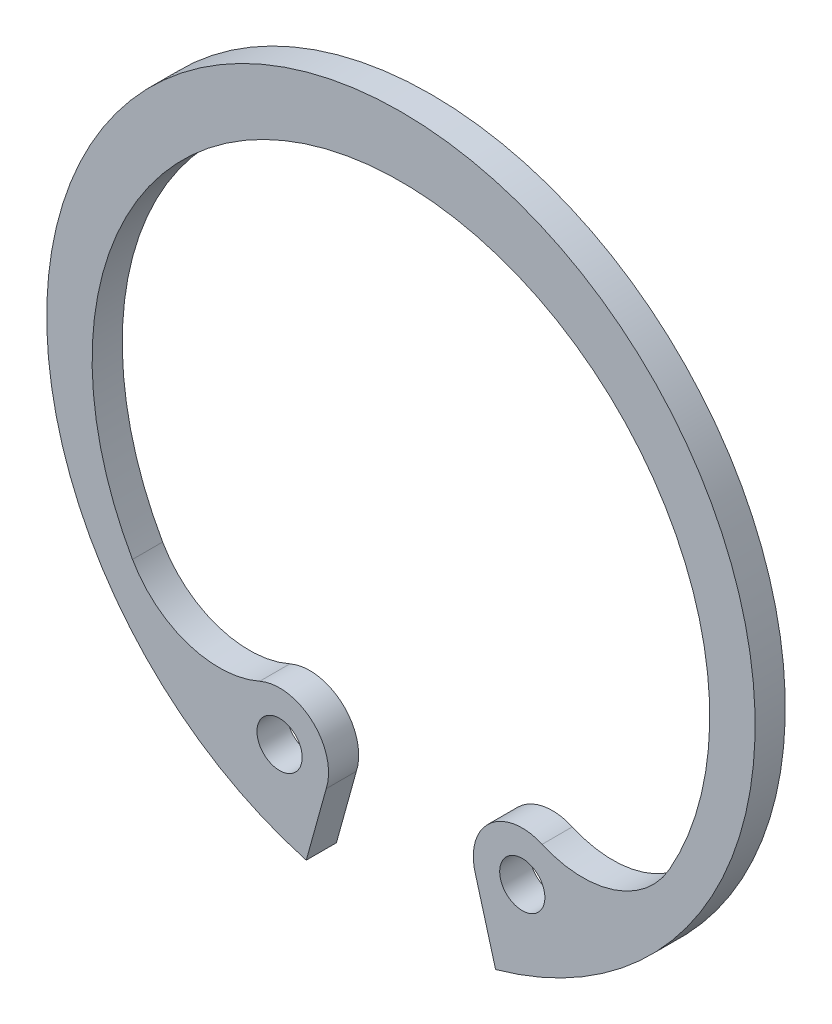
ISO-10303-21;
HEADER;
FILE_DESCRIPTION(('STEP AP214'),'2;1');
FILE_NAME('part.step','',(''),(''),'','','');
FILE_SCHEMA(('AUTOMOTIVE_DESIGN { 1 0 10303 214 1 1 1 1 }'));
ENDSEC;
DATA;
#1=APPLICATION_CONTEXT('core data for automotive mechanical design processes');
#2=APPLICATION_PROTOCOL_DEFINITION('international standard','automotive_design',2000,#1);
#3=PRODUCT_CONTEXT('',#1,'mechanical');
#4=PRODUCT('Part','Part','',(#3));
#5=PRODUCT_RELATED_PRODUCT_CATEGORY('part','',(#4));
#6=PRODUCT_DEFINITION_FORMATION('','',#4);
#7=PRODUCT_DEFINITION_CONTEXT('part definition',#1,'design');
#8=PRODUCT_DEFINITION('design','',#6,#7);
#9=PRODUCT_DEFINITION_SHAPE('','',#8);
#10=(LENGTH_UNIT() NAMED_UNIT(*) SI_UNIT(.MILLI.,.METRE.));
#11=(NAMED_UNIT(*) PLANE_ANGLE_UNIT() SI_UNIT($,.RADIAN.));
#12=(NAMED_UNIT(*) SI_UNIT($,.STERADIAN.) SOLID_ANGLE_UNIT());
#13=UNCERTAINTY_MEASURE_WITH_UNIT(LENGTH_MEASURE(1.E-05),#10,'distance_accuracy_value','');
#14=(GEOMETRIC_REPRESENTATION_CONTEXT(3) GLOBAL_UNCERTAINTY_ASSIGNED_CONTEXT((#13)) GLOBAL_UNIT_ASSIGNED_CONTEXT((#10,
#11,#12)) REPRESENTATION_CONTEXT('',''));
#15=CARTESIAN_POINT('',(0.,0.,0.));
#16=DIRECTION('',(0.,0.,1.));
#17=DIRECTION('',(1.,0.,0.));
#18=AXIS2_PLACEMENT_3D('',#15,#16,#17);
#19=CARTESIAN_POINT('',(0.,0.,-1.));
#20=DIRECTION('',(0.,0.,1.));
#21=DIRECTION('',(1.,0.,0.));
#22=AXIS2_PLACEMENT_3D('',#19,#20,#21);
#23=CYLINDRICAL_SURFACE('',#22,11.75);
#24=CARTESIAN_POINT('',(0.,0.,0.));
#25=DIRECTION('',(0.,0.,1.));
#26=DIRECTION('',(-1.,0.,0.));
#27=AXIS2_PLACEMENT_3D('',#24,#25,#26);
#28=CIRCLE('',#27,11.75);
#29=CARTESIAN_POINT('',(3.14005091891952,-11.3226578252013,0.));
#30=VERTEX_POINT('',#29);
#31=CARTESIAN_POINT('',(-3.14005091891952,-11.3226578252013,0.));
#32=VERTEX_POINT('',#31);
#33=EDGE_CURVE('E142',#30,#32,#28,.T.);
#34=ORIENTED_EDGE('',*,*,#33,.F.);
#35=DIRECTION('',(0.,0.,1.));
#36=VECTOR('',#35,1.);
#37=CARTESIAN_POINT('',(3.14005091891952,-11.3226578252013,-1.));
#38=LINE('',#37,#36);
#39=CARTESIAN_POINT('',(3.14005091891952,-11.3226578252013,-1.));
#40=VERTEX_POINT('',#39);
#41=EDGE_CURVE('E11',#40,#30,#38,.T.);
#42=ORIENTED_EDGE('',*,*,#41,.F.);
#43=CARTESIAN_POINT('',(0.,0.,-1.));
#44=DIRECTION('',(0.,0.,1.));
#45=DIRECTION('',(-1.,0.,0.));
#46=AXIS2_PLACEMENT_3D('',#43,#44,#45);
#47=CIRCLE('',#46,11.75);
#48=CARTESIAN_POINT('',(-3.14005091891952,-11.3226578252013,-1.));
#49=VERTEX_POINT('',#48);
#50=EDGE_CURVE('E163',#40,#49,#47,.T.);
#51=ORIENTED_EDGE('',*,*,#50,.T.);
#52=DIRECTION('',(0.,0.,1.));
#53=VECTOR('',#52,1.);
#54=CARTESIAN_POINT('',(-3.14005091891952,-11.3226578252013,-1.));
#55=LINE('',#54,#53);
#56=EDGE_CURVE('E48',#49,#32,#55,.T.);
#57=ORIENTED_EDGE('',*,*,#56,.T.);
#58=EDGE_LOOP('',(#34,#42,#51,#57));
#59=FACE_BOUND('',#58,.T.);
#60=ADVANCED_FACE('F45',(#59),#23,.T.);
#61=CARTESIAN_POINT('',(3.14005091891952,-11.3226578252013,-1.));
#62=DIRECTION('',(-0.963630453208623,-0.267238376078258,0.));
#63=DIRECTION('',(0.267238376078258,-0.963630453208623,0.));
#64=AXIS2_PLACEMENT_3D('',#61,#62,#63);
#65=PLANE('',#64);
#66=DIRECTION('',(0.267238376078258,-0.963630453208623,0.));
#67=VECTOR('',#66,1.);
#68=CARTESIAN_POINT('',(3.14005091891952,-11.3226578252013,0.));
#69=LINE('',#68,#67);
#70=CARTESIAN_POINT('',(2.47867317035676,-8.93780670859745,0.));
#71=VERTEX_POINT('',#70);
#72=EDGE_CURVE('E161',#71,#30,#69,.T.);
#73=ORIENTED_EDGE('',*,*,#72,.F.);
#74=DIRECTION('',(0.,0.,1.));
#75=VECTOR('',#74,1.);
#76=CARTESIAN_POINT('',(2.47867317035676,-8.93780670859745,-1.));
#77=LINE('',#76,#75);
#78=CARTESIAN_POINT('',(2.47867317035676,-8.93780670859745,-1.));
#79=VERTEX_POINT('',#78);
#80=EDGE_CURVE('E54',#79,#71,#77,.T.);
#81=ORIENTED_EDGE('',*,*,#80,.F.);
#82=DIRECTION('',(0.267238376078258,-0.963630453208623,0.));
#83=VECTOR('',#82,1.);
#84=CARTESIAN_POINT('',(3.14005091891952,-11.3226578252013,-1.));
#85=LINE('',#84,#83);
#86=EDGE_CURVE('E132',#79,#40,#85,.T.);
#87=ORIENTED_EDGE('',*,*,#86,.T.);
#88=ORIENTED_EDGE('',*,*,#41,.T.);
#89=EDGE_LOOP('',(#73,#81,#87,#88));
#90=FACE_BOUND('',#89,.T.);
#91=ADVANCED_FACE('F175',(#90),#65,.T.);
#92=CARTESIAN_POINT('',(4.02527875515757,-8.43917240867119,-1.));
#93=DIRECTION('',(0.,0.,1.));
#94=DIRECTION('',(1.,0.,0.));
#95=AXIS2_PLACEMENT_3D('',#92,#93,#94);
#96=CYLINDRICAL_SURFACE('',#95,1.625);
#97=CARTESIAN_POINT('',(4.02527875515757,-8.43917240867119,0.));
#98=DIRECTION('',(0.,0.,1.));
#99=DIRECTION('',(-1.,0.,0.));
#100=AXIS2_PLACEMENT_3D('',#97,#98,#99);
#101=CIRCLE('',#100,1.625);
#102=CARTESIAN_POINT('',(4.68420775376061,-6.95376419043622,0.));
#103=VERTEX_POINT('',#102);
#104=EDGE_CURVE('E119',#103,#71,#101,.T.);
#105=ORIENTED_EDGE('',*,*,#104,.F.);
#106=DIRECTION('',(0.,0.,1.));
#107=VECTOR('',#106,1.);
#108=CARTESIAN_POINT('',(4.68420775376061,-6.95376419043622,-1.));
#109=LINE('',#108,#107);
#110=CARTESIAN_POINT('',(4.68420775376061,-6.95376419043622,-1.));
#111=VERTEX_POINT('',#110);
#112=EDGE_CURVE('E114',#111,#103,#109,.T.);
#113=ORIENTED_EDGE('',*,*,#112,.F.);
#114=CARTESIAN_POINT('',(4.02527875515757,-8.43917240867119,-1.));
#115=DIRECTION('',(0.,0.,1.));
#116=DIRECTION('',(-1.,0.,0.));
#117=AXIS2_PLACEMENT_3D('',#114,#115,#116);
#118=CIRCLE('',#117,1.625);
#119=EDGE_CURVE('E117',#111,#79,#118,.T.);
#120=ORIENTED_EDGE('',*,*,#119,.T.);
#121=ORIENTED_EDGE('',*,*,#80,.T.);
#122=EDGE_LOOP('',(#105,#113,#120,#121));
#123=FACE_BOUND('',#122,.T.);
#124=ADVANCED_FACE('F116',(#123),#96,.T.);
#125=CARTESIAN_POINT('',(6.02667257386982,-3.92747716905888,-1.));
#126=DIRECTION('',(0.,0.,1.));
#127=DIRECTION('',(1.,0.,0.));
#128=AXIS2_PLACEMENT_3D('',#125,#126,#127);
#129=CYLINDRICAL_SURFACE('',#128,3.31068345345606);
#130=CARTESIAN_POINT('',(6.02667257386982,-3.92747716905888,0.));
#131=DIRECTION('',(0.,0.,-1.));
#132=DIRECTION('',(1.,0.,0.));
#133=AXIS2_PLACEMENT_3D('',#130,#131,#132);
#134=CIRCLE('',#133,3.31068345345606);
#135=CARTESIAN_POINT('',(8.90450500964249,-5.56415227444862,0.));
#136=VERTEX_POINT('',#135);
#137=EDGE_CURVE('E158',#136,#103,#134,.T.);
#138=ORIENTED_EDGE('',*,*,#137,.F.);
#139=DIRECTION('',(0.,0.,1.));
#140=VECTOR('',#139,1.);
#141=CARTESIAN_POINT('',(8.90450500964249,-5.56415227444862,-1.));
#142=LINE('',#141,#140);
#143=CARTESIAN_POINT('',(8.90450500964249,-5.56415227444862,-1.));
#144=VERTEX_POINT('',#143);
#145=EDGE_CURVE('E124',#144,#136,#142,.T.);
#146=ORIENTED_EDGE('',*,*,#145,.F.);
#147=CARTESIAN_POINT('',(6.02667257386982,-3.92747716905888,-1.));
#148=DIRECTION('',(0.,0.,-1.));
#149=DIRECTION('',(1.,0.,0.));
#150=AXIS2_PLACEMENT_3D('',#147,#148,#149);
#151=CIRCLE('',#150,3.31068345345606);
#152=EDGE_CURVE('E130',#144,#111,#151,.T.);
#153=ORIENTED_EDGE('',*,*,#152,.T.);
#154=ORIENTED_EDGE('',*,*,#112,.T.);
#155=EDGE_LOOP('',(#138,#146,#153,#154));
#156=FACE_BOUND('',#155,.T.);
#157=ADVANCED_FACE('F134',(#156),#129,.F.);
#158=CARTESIAN_POINT('',(0.,-0.5,-1.));
#159=DIRECTION('',(0.,0.,1.));
#160=DIRECTION('',(1.,0.,0.));
#161=AXIS2_PLACEMENT_3D('',#158,#159,#160);
#162=CYLINDRICAL_SURFACE('',#161,10.2438199772132);
#163=CARTESIAN_POINT('',(0.,-0.5,0.));
#164=DIRECTION('',(0.,0.,-1.));
#165=DIRECTION('',(-1.,0.,0.));
#166=AXIS2_PLACEMENT_3D('',#163,#164,#165);
#167=CIRCLE('',#166,10.2438199772132);
#168=CARTESIAN_POINT('',(-8.90450500964248,-5.56415227444863,0.));
#169=VERTEX_POINT('',#168);
#170=EDGE_CURVE('E155',#169,#136,#167,.T.);
#171=ORIENTED_EDGE('',*,*,#170,.F.);
#172=DIRECTION('',(0.,0.,1.));
#173=VECTOR('',#172,1.);
#174=CARTESIAN_POINT('',(-8.90450500964248,-5.56415227444863,-1.));
#175=LINE('',#174,#173);
#176=CARTESIAN_POINT('',(-8.90450500964248,-5.56415227444863,-1.));
#177=VERTEX_POINT('',#176);
#178=EDGE_CURVE('E167',#177,#169,#175,.T.);
#179=ORIENTED_EDGE('',*,*,#178,.F.);
#180=CARTESIAN_POINT('',(0.,-0.5,-1.));
#181=DIRECTION('',(0.,0.,-1.));
#182=DIRECTION('',(-1.,0.,0.));
#183=AXIS2_PLACEMENT_3D('',#180,#181,#182);
#184=CIRCLE('',#183,10.2438199772132);
#185=EDGE_CURVE('E135',#177,#144,#184,.T.);
#186=ORIENTED_EDGE('',*,*,#185,.T.);
#187=ORIENTED_EDGE('',*,*,#145,.T.);
#188=EDGE_LOOP('',(#171,#179,#186,#187));
#189=FACE_BOUND('',#188,.T.);
#190=ADVANCED_FACE('F188',(#189),#162,.F.);
#191=CARTESIAN_POINT('',(-6.02667257386982,-3.92747716905888,-1.));
#192=DIRECTION('',(0.,0.,1.));
#193=DIRECTION('',(1.,0.,0.));
#194=AXIS2_PLACEMENT_3D('',#191,#192,#193);
#195=CYLINDRICAL_SURFACE('',#194,3.31068345345606);
#196=CARTESIAN_POINT('',(-6.02667257386982,-3.92747716905888,0.));
#197=DIRECTION('',(0.,0.,-1.));
#198=DIRECTION('',(-1.,0.,0.));
#199=AXIS2_PLACEMENT_3D('',#196,#197,#198);
#200=CIRCLE('',#199,3.31068345345606);
#201=CARTESIAN_POINT('',(-4.68420775376061,-6.95376419043622,0.));
#202=VERTEX_POINT('',#201);
#203=EDGE_CURVE('E152',#202,#169,#200,.T.);
#204=ORIENTED_EDGE('',*,*,#203,.F.);
#205=DIRECTION('',(0.,0.,1.));
#206=VECTOR('',#205,1.);
#207=CARTESIAN_POINT('',(-4.68420775376061,-6.95376419043622,-1.));
#208=LINE('',#207,#206);
#209=CARTESIAN_POINT('',(-4.68420775376061,-6.95376419043622,-1.));
#210=VERTEX_POINT('',#209);
#211=EDGE_CURVE('E169',#210,#202,#208,.T.);
#212=ORIENTED_EDGE('',*,*,#211,.F.);
#213=CARTESIAN_POINT('',(-6.02667257386982,-3.92747716905888,-1.));
#214=DIRECTION('',(0.,0.,-1.));
#215=DIRECTION('',(-1.,0.,0.));
#216=AXIS2_PLACEMENT_3D('',#213,#214,#215);
#217=CIRCLE('',#216,3.31068345345606);
#218=EDGE_CURVE('E137',#210,#177,#217,.T.);
#219=ORIENTED_EDGE('',*,*,#218,.T.);
#220=ORIENTED_EDGE('',*,*,#178,.T.);
#221=EDGE_LOOP('',(#204,#212,#219,#220));
#222=FACE_BOUND('',#221,.T.);
#223=ADVANCED_FACE('F191',(#222),#195,.F.);
#224=CARTESIAN_POINT('',(-4.02527875515757,-8.43917240867119,-1.));
#225=DIRECTION('',(0.,0.,1.));
#226=DIRECTION('',(1.,0.,0.));
#227=AXIS2_PLACEMENT_3D('',#224,#225,#226);
#228=CYLINDRICAL_SURFACE('',#227,1.625);
#229=CARTESIAN_POINT('',(-4.02527875515757,-8.43917240867119,0.));
#230=DIRECTION('',(0.,0.,1.));
#231=DIRECTION('',(1.,0.,0.));
#232=AXIS2_PLACEMENT_3D('',#229,#230,#231);
#233=CIRCLE('',#232,1.625);
#234=CARTESIAN_POINT('',(-2.47867317035676,-8.93780670859745,0.));
#235=VERTEX_POINT('',#234);
#236=EDGE_CURVE('E149',#235,#202,#233,.T.);
#237=ORIENTED_EDGE('',*,*,#236,.F.);
#238=DIRECTION('',(0.,0.,1.));
#239=VECTOR('',#238,1.);
#240=CARTESIAN_POINT('',(-2.47867317035676,-8.93780670859745,-1.));
#241=LINE('',#240,#239);
#242=CARTESIAN_POINT('',(-2.47867317035676,-8.93780670859745,-1.));
#243=VERTEX_POINT('',#242);
#244=EDGE_CURVE('E170',#243,#235,#241,.T.);
#245=ORIENTED_EDGE('',*,*,#244,.F.);
#246=CARTESIAN_POINT('',(-4.02527875515757,-8.43917240867119,-1.));
#247=DIRECTION('',(0.,0.,1.));
#248=DIRECTION('',(1.,0.,0.));
#249=AXIS2_PLACEMENT_3D('',#246,#247,#248);
#250=CIRCLE('',#249,1.625);
#251=EDGE_CURVE('E237',#243,#210,#250,.T.);
#252=ORIENTED_EDGE('',*,*,#251,.T.);
#253=ORIENTED_EDGE('',*,*,#211,.T.);
#254=EDGE_LOOP('',(#237,#245,#252,#253));
#255=FACE_BOUND('',#254,.T.);
#256=ADVANCED_FACE('F195',(#255),#228,.T.);
#257=CARTESIAN_POINT('',(-3.14005091891952,-11.3226578252013,-1.));
#258=DIRECTION('',(0.963630453208623,-0.267238376078257,0.));
#259=DIRECTION('',(0.267238376078257,0.963630453208623,0.));
#260=AXIS2_PLACEMENT_3D('',#257,#258,#259);
#261=PLANE('',#260);
#262=DIRECTION('',(0.267238376078257,0.963630453208623,0.));
#263=VECTOR('',#262,1.);
#264=CARTESIAN_POINT('',(-3.14005091891952,-11.3226578252013,0.));
#265=LINE('',#264,#263);
#266=EDGE_CURVE('E145',#32,#235,#265,.T.);
#267=ORIENTED_EDGE('',*,*,#266,.F.);
#268=ORIENTED_EDGE('',*,*,#56,.F.);
#269=DIRECTION('',(0.267238376078257,0.963630453208623,0.));
#270=VECTOR('',#269,1.);
#271=CARTESIAN_POINT('',(-3.14005091891952,-11.3226578252013,-1.));
#272=LINE('',#271,#270);
#273=EDGE_CURVE('E235',#49,#243,#272,.T.);
#274=ORIENTED_EDGE('',*,*,#273,.T.);
#275=ORIENTED_EDGE('',*,*,#244,.T.);
#276=EDGE_LOOP('',(#267,#268,#274,#275));
#277=FACE_BOUND('',#276,.T.);
#278=ADVANCED_FACE('F172',(#277),#261,.T.);
#279=CARTESIAN_POINT('',(0.,0.,-1.));
#280=DIRECTION('',(0.,0.,-1.));
#281=DIRECTION('',(-1.,0.,0.));
#282=AXIS2_PLACEMENT_3D('',#279,#280,#281);
#283=PLANE('',#282);
#284=CARTESIAN_POINT('',(4.02527875515757,-8.43917240867119,-1.));
#285=DIRECTION('',(0.,0.,1.));
#286=DIRECTION('',(-1.,0.,0.));
#287=AXIS2_PLACEMENT_3D('',#284,#285,#286);
#288=CIRCLE('',#287,0.75);
#289=CARTESIAN_POINT('',(3.27527875515757,-8.43917240867119,-1.));
#290=VERTEX_POINT('',#289);
#291=EDGE_CURVE('E222',#290,#290,#288,.T.);
#292=ORIENTED_EDGE('',*,*,#291,.T.);
#293=EDGE_LOOP('',(#292));
#294=FACE_BOUND('',#293,.T.);
#295=CARTESIAN_POINT('',(-4.02527875515757,-8.43917240867119,-1.));
#296=DIRECTION('',(0.,0.,1.));
#297=DIRECTION('',(1.,0.,0.));
#298=AXIS2_PLACEMENT_3D('',#295,#296,#297);
#299=CIRCLE('',#298,0.75);
#300=CARTESIAN_POINT('',(-3.27527875515757,-8.43917240867119,-1.));
#301=VERTEX_POINT('',#300);
#302=EDGE_CURVE('E146',#301,#301,#299,.T.);
#303=ORIENTED_EDGE('',*,*,#302,.T.);
#304=EDGE_LOOP('',(#303));
#305=FACE_BOUND('',#304,.T.);
#306=ORIENTED_EDGE('',*,*,#50,.F.);
#307=ORIENTED_EDGE('',*,*,#86,.F.);
#308=ORIENTED_EDGE('',*,*,#119,.F.);
#309=ORIENTED_EDGE('',*,*,#152,.F.);
#310=ORIENTED_EDGE('',*,*,#185,.F.);
#311=ORIENTED_EDGE('',*,*,#218,.F.);
#312=ORIENTED_EDGE('',*,*,#251,.F.);
#313=ORIENTED_EDGE('',*,*,#273,.F.);
#314=EDGE_LOOP('',(#306,#307,#308,#309,#310,#311,#312,#313));
#315=FACE_BOUND('',#314,.T.);
#316=ADVANCED_FACE('F128',(#294,#305,#315),#283,.T.);
#317=CARTESIAN_POINT('',(0.,0.,0.));
#318=DIRECTION('',(0.,0.,-1.));
#319=DIRECTION('',(-1.,0.,0.));
#320=AXIS2_PLACEMENT_3D('',#317,#318,#319);
#321=PLANE('',#320);
#322=CARTESIAN_POINT('',(4.02527875515757,-8.43917240867119,0.));
#323=DIRECTION('',(0.,0.,1.));
#324=DIRECTION('',(-1.,0.,0.));
#325=AXIS2_PLACEMENT_3D('',#322,#323,#324);
#326=CIRCLE('',#325,0.75);
#327=CARTESIAN_POINT('',(3.27527875515757,-8.43917240867119,0.));
#328=VERTEX_POINT('',#327);
#329=EDGE_CURVE('E225',#328,#328,#326,.T.);
#330=ORIENTED_EDGE('',*,*,#329,.F.);
#331=EDGE_LOOP('',(#330));
#332=FACE_BOUND('',#331,.T.);
#333=CARTESIAN_POINT('',(-4.02527875515757,-8.43917240867119,0.));
#334=DIRECTION('',(0.,0.,1.));
#335=DIRECTION('',(1.,0.,0.));
#336=AXIS2_PLACEMENT_3D('',#333,#334,#335);
#337=CIRCLE('',#336,0.75);
#338=CARTESIAN_POINT('',(-3.27527875515757,-8.43917240867119,0.));
#339=VERTEX_POINT('',#338);
#340=EDGE_CURVE('E227',#339,#339,#337,.T.);
#341=ORIENTED_EDGE('',*,*,#340,.F.);
#342=EDGE_LOOP('',(#341));
#343=FACE_BOUND('',#342,.T.);
#344=ORIENTED_EDGE('',*,*,#33,.T.);
#345=ORIENTED_EDGE('',*,*,#266,.T.);
#346=ORIENTED_EDGE('',*,*,#236,.T.);
#347=ORIENTED_EDGE('',*,*,#203,.T.);
#348=ORIENTED_EDGE('',*,*,#170,.T.);
#349=ORIENTED_EDGE('',*,*,#137,.T.);
#350=ORIENTED_EDGE('',*,*,#104,.T.);
#351=ORIENTED_EDGE('',*,*,#72,.T.);
#352=EDGE_LOOP('',(#344,#345,#346,#347,#348,#349,#350,#351));
#353=FACE_BOUND('',#352,.T.);
#354=ADVANCED_FACE('F174',(#332,#343,#353),#321,.F.);
#355=CARTESIAN_POINT('',(-4.02527875515757,-8.43917240867119,-1.));
#356=DIRECTION('',(0.,0.,1.));
#357=DIRECTION('',(1.,0.,0.));
#358=AXIS2_PLACEMENT_3D('',#355,#356,#357);
#359=CYLINDRICAL_SURFACE('',#358,0.75);
#360=ORIENTED_EDGE('',*,*,#302,.F.);
#361=EDGE_LOOP('',(#360));
#362=FACE_BOUND('',#361,.T.);
#363=ORIENTED_EDGE('',*,*,#340,.T.);
#364=EDGE_LOOP('',(#363));
#365=FACE_BOUND('',#364,.T.);
#366=ADVANCED_FACE('F207',(#362,#365),#359,.F.);
#367=CARTESIAN_POINT('',(4.02527875515757,-8.43917240867119,-1.));
#368=DIRECTION('',(0.,0.,1.));
#369=DIRECTION('',(1.,0.,0.));
#370=AXIS2_PLACEMENT_3D('',#367,#368,#369);
#371=CYLINDRICAL_SURFACE('',#370,0.75);
#372=ORIENTED_EDGE('',*,*,#291,.F.);
#373=EDGE_LOOP('',(#372));
#374=FACE_BOUND('',#373,.T.);
#375=ORIENTED_EDGE('',*,*,#329,.T.);
#376=EDGE_LOOP('',(#375));
#377=FACE_BOUND('',#376,.T.);
#378=ADVANCED_FACE('F214',(#374,#377),#371,.F.);
#379=CLOSED_SHELL('',(#60,#91,#124,#157,#190,#223,#256,#278,#316,#354,#366,#378));
#380=MANIFOLD_SOLID_BREP('B2',#379);
#381=ADVANCED_BREP_SHAPE_REPRESENTATION('',(#18,#380),#14);
#382=SHAPE_DEFINITION_REPRESENTATION(#9,#381);
ENDSEC;
END-ISO-10303-21;
